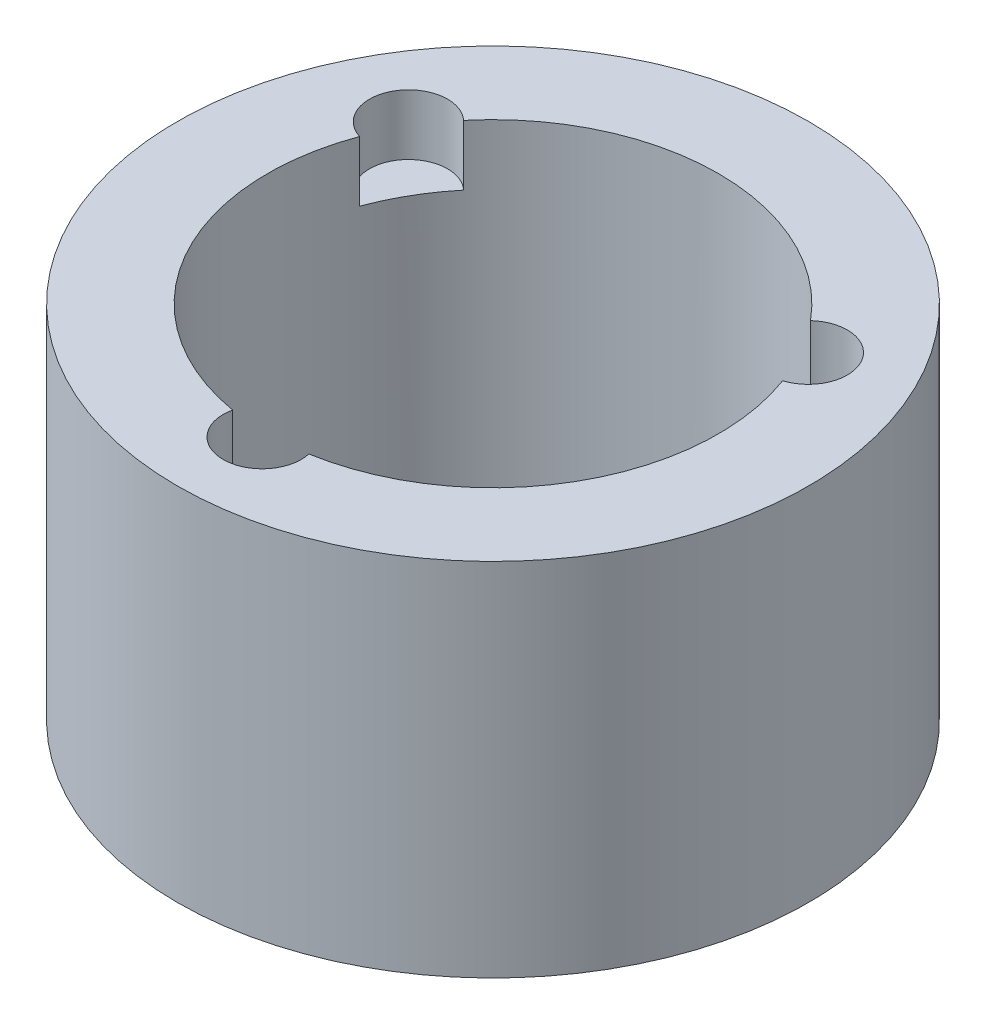
ISO-10303-21;
HEADER;
FILE_DESCRIPTION(('STEP AP214'),'2;1');
FILE_NAME('part.step','',(''),(''),'','','');
FILE_SCHEMA(('AUTOMOTIVE_DESIGN { 1 0 10303 214 1 1 1 1 }'));
ENDSEC;
DATA;
#1=APPLICATION_CONTEXT('core data for automotive mechanical design processes');
#2=APPLICATION_PROTOCOL_DEFINITION('international standard','automotive_design',2000,#1);
#3=PRODUCT_CONTEXT('',#1,'mechanical');
#4=PRODUCT('Part','Part','',(#3));
#5=PRODUCT_RELATED_PRODUCT_CATEGORY('part','',(#4));
#6=PRODUCT_DEFINITION_FORMATION('','',#4);
#7=PRODUCT_DEFINITION_CONTEXT('part definition',#1,'design');
#8=PRODUCT_DEFINITION('design','',#6,#7);
#9=PRODUCT_DEFINITION_SHAPE('','',#8);
#10=(LENGTH_UNIT() NAMED_UNIT(*) SI_UNIT(.MILLI.,.METRE.));
#11=(NAMED_UNIT(*) PLANE_ANGLE_UNIT() SI_UNIT($,.RADIAN.));
#12=(NAMED_UNIT(*) SI_UNIT($,.STERADIAN.) SOLID_ANGLE_UNIT());
#13=UNCERTAINTY_MEASURE_WITH_UNIT(LENGTH_MEASURE(1.E-05),#10,'distance_accuracy_value','');
#14=(GEOMETRIC_REPRESENTATION_CONTEXT(3) GLOBAL_UNCERTAINTY_ASSIGNED_CONTEXT((#13)) GLOBAL_UNIT_ASSIGNED_CONTEXT((#10,
#11,#12)) REPRESENTATION_CONTEXT('',''));
#15=CARTESIAN_POINT('',(0.,0.,0.));
#16=DIRECTION('',(0.,0.,1.));
#17=DIRECTION('',(1.,0.,0.));
#18=AXIS2_PLACEMENT_3D('',#15,#16,#17);
#19=CARTESIAN_POINT('',(0.,50.8,0.));
#20=DIRECTION('',(0.,1.,0.));
#21=DIRECTION('',(0.,0.,1.));
#22=AXIS2_PLACEMENT_3D('',#19,#20,#21);
#23=PLANE('',#22);
#24=CARTESIAN_POINT('',(28.1458256229943,50.8,-16.2499999999999));
#25=DIRECTION('',(0.,1.,0.));
#26=DIRECTION('',(0.,0.,1.));
#27=AXIS2_PLACEMENT_3D('',#24,#25,#26);
#28=CIRCLE('',#27,5.5);
#29=CARTESIAN_POINT('',(29.7837588929475,50.8,-10.999554818572));
#30=VERTEX_POINT('',#29);
#31=CARTESIAN_POINT('',(24.4177733496767,50.8,-20.2937144121972));
#32=VERTEX_POINT('',#31);
#33=EDGE_CURVE('E86',#30,#32,#28,.T.);
#34=ORIENTED_EDGE('',*,*,#33,.F.);
#35=CARTESIAN_POINT('',(0.,50.8,0.));
#36=DIRECTION('',(0.,1.,0.));
#37=DIRECTION('',(0.,0.,1.));
#38=AXIS2_PLACEMENT_3D('',#35,#36,#37);
#39=CIRCLE('',#38,31.75);
#40=CARTESIAN_POINT('',(5.36598554327085,50.8,31.2932692307692));
#41=VERTEX_POINT('',#40);
#42=EDGE_CURVE('E96',#41,#30,#39,.T.);
#43=ORIENTED_EDGE('',*,*,#42,.F.);
#44=CARTESIAN_POINT('',(0.,50.8,32.5));
#45=DIRECTION('',(0.,1.,0.));
#46=DIRECTION('',(0.,0.,1.));
#47=AXIS2_PLACEMENT_3D('',#44,#45,#46);
#48=CIRCLE('',#47,5.5);
#49=CARTESIAN_POINT('',(-5.36598554327084,50.8,31.2932692307692));
#50=VERTEX_POINT('',#49);
#51=EDGE_CURVE('E232',#50,#41,#48,.T.);
#52=ORIENTED_EDGE('',*,*,#51,.F.);
#53=CARTESIAN_POINT('',(-29.7837588929474,50.8,-10.9995548185722));
#54=VERTEX_POINT('',#53);
#55=EDGE_CURVE('E105',#54,#50,#39,.T.);
#56=ORIENTED_EDGE('',*,*,#55,.F.);
#57=CARTESIAN_POINT('',(-28.1458256229942,50.8,-16.2500000000001));
#58=DIRECTION('',(0.,1.,0.));
#59=DIRECTION('',(0.,0.,1.));
#60=AXIS2_PLACEMENT_3D('',#57,#58,#59);
#61=CIRCLE('',#60,5.5);
#62=CARTESIAN_POINT('',(-24.4177733496766,50.8,-20.2937144121973));
#63=VERTEX_POINT('',#62);
#64=EDGE_CURVE('E112',#63,#54,#61,.T.);
#65=ORIENTED_EDGE('',*,*,#64,.F.);
#66=EDGE_CURVE('E98',#32,#63,#39,.T.);
#67=ORIENTED_EDGE('',*,*,#66,.F.);
#68=EDGE_LOOP('',(#34,#43,#52,#56,#65,#67));
#69=FACE_BOUND('',#68,.T.);
#70=CARTESIAN_POINT('',(0.,50.8,0.));
#71=DIRECTION('',(0.,1.,0.));
#72=DIRECTION('',(0.,0.,1.));
#73=AXIS2_PLACEMENT_3D('',#70,#71,#72);
#74=CIRCLE('',#73,44.45);
#75=CARTESIAN_POINT('',(0.,50.8,44.45));
#76=VERTEX_POINT('',#75);
#77=EDGE_CURVE('E117',#76,#76,#74,.T.);
#78=ORIENTED_EDGE('',*,*,#77,.T.);
#79=EDGE_LOOP('',(#78));
#80=FACE_BOUND('',#79,.T.);
#81=ADVANCED_FACE('F33',(#69,#80),#23,.T.);
#82=CARTESIAN_POINT('',(0.,0.,0.));
#83=DIRECTION('',(0.,1.,0.));
#84=DIRECTION('',(0.,0.,1.));
#85=AXIS2_PLACEMENT_3D('',#82,#83,#84);
#86=PLANE('',#85);
#87=CARTESIAN_POINT('',(0.,0.,0.));
#88=DIRECTION('',(0.,1.,0.));
#89=DIRECTION('',(0.,0.,1.));
#90=AXIS2_PLACEMENT_3D('',#87,#88,#89);
#91=CIRCLE('',#90,44.45);
#92=CARTESIAN_POINT('',(0.,0.,44.45));
#93=VERTEX_POINT('',#92);
#94=EDGE_CURVE('E108',#93,#93,#91,.T.);
#95=ORIENTED_EDGE('',*,*,#94,.F.);
#96=EDGE_LOOP('',(#95));
#97=FACE_BOUND('',#96,.T.);
#98=CARTESIAN_POINT('',(0.,0.,0.));
#99=DIRECTION('',(0.,1.,0.));
#100=DIRECTION('',(0.,0.,1.));
#101=AXIS2_PLACEMENT_3D('',#98,#99,#100);
#102=CIRCLE('',#101,31.75);
#103=CARTESIAN_POINT('',(0.,0.,31.75));
#104=VERTEX_POINT('',#103);
#105=EDGE_CURVE('E109',#104,#104,#102,.T.);
#106=ORIENTED_EDGE('',*,*,#105,.T.);
#107=EDGE_LOOP('',(#106));
#108=FACE_BOUND('',#107,.T.);
#109=ADVANCED_FACE('F146',(#97,#108),#86,.F.);
#110=CARTESIAN_POINT('',(0.,50.8,0.));
#111=DIRECTION('',(0.,-1.,0.));
#112=DIRECTION('',(0.,0.,-1.));
#113=AXIS2_PLACEMENT_3D('',#110,#111,#112);
#114=CYLINDRICAL_SURFACE('',#113,44.45);
#115=ORIENTED_EDGE('',*,*,#77,.F.);
#116=EDGE_LOOP('',(#115));
#117=FACE_BOUND('',#116,.T.);
#118=ORIENTED_EDGE('',*,*,#94,.T.);
#119=EDGE_LOOP('',(#118));
#120=FACE_BOUND('',#119,.T.);
#121=ADVANCED_FACE('F35',(#117,#120),#114,.T.);
#122=CARTESIAN_POINT('',(0.,50.8,0.));
#123=DIRECTION('',(0.,-1.,0.));
#124=DIRECTION('',(0.,0.,-1.));
#125=AXIS2_PLACEMENT_3D('',#122,#123,#124);
#126=CYLINDRICAL_SURFACE('',#125,31.75);
#127=DIRECTION('',(0.,1.,0.));
#128=VECTOR('',#127,1.);
#129=CARTESIAN_POINT('',(29.7837588929475,46.55,-10.999554818572));
#130=LINE('',#129,#128);
#131=CARTESIAN_POINT('',(29.7837588929475,42.3,-10.999554818572));
#132=VERTEX_POINT('',#131);
#133=EDGE_CURVE('E11',#132,#30,#130,.T.);
#134=ORIENTED_EDGE('',*,*,#133,.F.);
#135=CARTESIAN_POINT('',(0.,42.3,0.));
#136=DIRECTION('',(0.,1.,0.));
#137=DIRECTION('',(0.,0.,1.));
#138=AXIS2_PLACEMENT_3D('',#135,#136,#137);
#139=CIRCLE('',#138,31.75);
#140=CARTESIAN_POINT('',(24.4177733496767,42.3,-20.2937144121972));
#141=VERTEX_POINT('',#140);
#142=EDGE_CURVE('E136',#132,#141,#139,.T.);
#143=ORIENTED_EDGE('',*,*,#142,.T.);
#144=DIRECTION('',(0.,1.,0.));
#145=VECTOR('',#144,1.);
#146=CARTESIAN_POINT('',(24.4177733496767,46.55,-20.2937144121972));
#147=LINE('',#146,#145);
#148=EDGE_CURVE('E41',#32,#141,#147,.F.);
#149=ORIENTED_EDGE('',*,*,#148,.F.);
#150=ORIENTED_EDGE('',*,*,#66,.T.);
#151=DIRECTION('',(0.,1.,0.));
#152=VECTOR('',#151,1.);
#153=CARTESIAN_POINT('',(-24.4177733496766,46.55,-20.2937144121973));
#154=LINE('',#153,#152);
#155=CARTESIAN_POINT('',(-24.4177733496766,42.3,-20.2937144121973));
#156=VERTEX_POINT('',#155);
#157=EDGE_CURVE('E128',#156,#63,#154,.T.);
#158=ORIENTED_EDGE('',*,*,#157,.F.);
#159=CARTESIAN_POINT('',(0.,42.3,0.));
#160=DIRECTION('',(0.,1.,0.));
#161=DIRECTION('',(0.,0.,1.));
#162=AXIS2_PLACEMENT_3D('',#159,#160,#161);
#163=CIRCLE('',#162,31.75);
#164=CARTESIAN_POINT('',(-29.7837588929474,42.3,-10.9995548185722));
#165=VERTEX_POINT('',#164);
#166=EDGE_CURVE('E120',#156,#165,#163,.T.);
#167=ORIENTED_EDGE('',*,*,#166,.T.);
#168=DIRECTION('',(0.,1.,0.));
#169=VECTOR('',#168,1.);
#170=CARTESIAN_POINT('',(-29.7837588929474,46.55,-10.9995548185722));
#171=LINE('',#170,#169);
#172=EDGE_CURVE('E125',#54,#165,#171,.F.);
#173=ORIENTED_EDGE('',*,*,#172,.F.);
#174=ORIENTED_EDGE('',*,*,#55,.T.);
#175=DIRECTION('',(0.,1.,0.));
#176=VECTOR('',#175,1.);
#177=CARTESIAN_POINT('',(-5.36598554327084,46.55,31.2932692307692));
#178=LINE('',#177,#176);
#179=CARTESIAN_POINT('',(-5.36598554327084,42.3,31.2932692307692));
#180=VERTEX_POINT('',#179);
#181=EDGE_CURVE('E134',#180,#50,#178,.T.);
#182=ORIENTED_EDGE('',*,*,#181,.F.);
#183=CARTESIAN_POINT('',(0.,42.3,0.));
#184=DIRECTION('',(0.,1.,0.));
#185=DIRECTION('',(0.,0.,1.));
#186=AXIS2_PLACEMENT_3D('',#183,#184,#185);
#187=CIRCLE('',#186,31.75);
#188=CARTESIAN_POINT('',(5.36598554327085,42.3,31.2932692307692));
#189=VERTEX_POINT('',#188);
#190=EDGE_CURVE('E131',#180,#189,#187,.T.);
#191=ORIENTED_EDGE('',*,*,#190,.T.);
#192=DIRECTION('',(0.,1.,0.));
#193=VECTOR('',#192,1.);
#194=CARTESIAN_POINT('',(5.36598554327085,46.55,31.2932692307692));
#195=LINE('',#194,#193);
#196=EDGE_CURVE('E104',#41,#189,#195,.F.);
#197=ORIENTED_EDGE('',*,*,#196,.F.);
#198=ORIENTED_EDGE('',*,*,#42,.T.);
#199=EDGE_LOOP('',(#134,#143,#149,#150,#158,#167,#173,#174,#182,#191,#197,#198));
#200=FACE_BOUND('',#199,.T.);
#201=ORIENTED_EDGE('',*,*,#105,.F.);
#202=EDGE_LOOP('',(#201));
#203=FACE_BOUND('',#202,.T.);
#204=ADVANCED_FACE('F101',(#200,#203),#126,.F.);
#205=CARTESIAN_POINT('',(-28.1458256229942,42.3,-16.2500000000001));
#206=DIRECTION('',(0.,1.,0.));
#207=DIRECTION('',(0.,0.,1.));
#208=AXIS2_PLACEMENT_3D('',#205,#206,#207);
#209=CYLINDRICAL_SURFACE('',#208,5.5);
#210=ORIENTED_EDGE('',*,*,#157,.T.);
#211=ORIENTED_EDGE('',*,*,#64,.T.);
#212=ORIENTED_EDGE('',*,*,#172,.T.);
#213=CARTESIAN_POINT('',(-28.1458256229942,42.3,-16.2500000000001));
#214=DIRECTION('',(0.,1.,0.));
#215=DIRECTION('',(0.,0.,1.));
#216=AXIS2_PLACEMENT_3D('',#213,#214,#215);
#217=CIRCLE('',#216,5.5);
#218=EDGE_CURVE('E116',#156,#165,#217,.T.);
#219=ORIENTED_EDGE('',*,*,#218,.F.);
#220=EDGE_LOOP('',(#210,#211,#212,#219));
#221=FACE_BOUND('',#220,.T.);
#222=ADVANCED_FACE('F155',(#221),#209,.F.);
#223=CARTESIAN_POINT('',(-28.1458256229942,42.3,-16.2500000000001));
#224=DIRECTION('',(0.,1.,0.));
#225=DIRECTION('',(0.,0.,1.));
#226=AXIS2_PLACEMENT_3D('',#223,#224,#225);
#227=PLANE('',#226);
#228=ORIENTED_EDGE('',*,*,#218,.T.);
#229=ORIENTED_EDGE('',*,*,#166,.F.);
#230=EDGE_LOOP('',(#228,#229));
#231=FACE_BOUND('',#230,.T.);
#232=ADVANCED_FACE('F158',(#231),#227,.T.);
#233=CARTESIAN_POINT('',(0.,42.3,32.5));
#234=DIRECTION('',(0.,1.,0.));
#235=DIRECTION('',(0.,0.,1.));
#236=AXIS2_PLACEMENT_3D('',#233,#234,#235);
#237=CYLINDRICAL_SURFACE('',#236,5.5);
#238=ORIENTED_EDGE('',*,*,#181,.T.);
#239=ORIENTED_EDGE('',*,*,#51,.T.);
#240=ORIENTED_EDGE('',*,*,#196,.T.);
#241=CARTESIAN_POINT('',(0.,42.3,32.5));
#242=DIRECTION('',(0.,1.,0.));
#243=DIRECTION('',(0.,0.,1.));
#244=AXIS2_PLACEMENT_3D('',#241,#242,#243);
#245=CIRCLE('',#244,5.5);
#246=EDGE_CURVE('E54',#180,#189,#245,.T.);
#247=ORIENTED_EDGE('',*,*,#246,.F.);
#248=EDGE_LOOP('',(#238,#239,#240,#247));
#249=FACE_BOUND('',#248,.T.);
#250=ADVANCED_FACE('F162',(#249),#237,.F.);
#251=CARTESIAN_POINT('',(0.,42.3,32.5));
#252=DIRECTION('',(0.,1.,0.));
#253=DIRECTION('',(0.,0.,1.));
#254=AXIS2_PLACEMENT_3D('',#251,#252,#253);
#255=PLANE('',#254);
#256=ORIENTED_EDGE('',*,*,#246,.T.);
#257=ORIENTED_EDGE('',*,*,#190,.F.);
#258=EDGE_LOOP('',(#256,#257));
#259=FACE_BOUND('',#258,.T.);
#260=ADVANCED_FACE('F143',(#259),#255,.T.);
#261=CARTESIAN_POINT('',(28.1458256229943,42.3,-16.2499999999999));
#262=DIRECTION('',(0.,1.,0.));
#263=DIRECTION('',(0.,0.,1.));
#264=AXIS2_PLACEMENT_3D('',#261,#262,#263);
#265=CYLINDRICAL_SURFACE('',#264,5.5);
#266=ORIENTED_EDGE('',*,*,#133,.T.);
#267=ORIENTED_EDGE('',*,*,#33,.T.);
#268=ORIENTED_EDGE('',*,*,#148,.T.);
#269=CARTESIAN_POINT('',(28.1458256229943,42.3,-16.2499999999999));
#270=DIRECTION('',(0.,1.,0.));
#271=DIRECTION('',(0.,0.,1.));
#272=AXIS2_PLACEMENT_3D('',#269,#270,#271);
#273=CIRCLE('',#272,5.5);
#274=EDGE_CURVE('E47',#132,#141,#273,.T.);
#275=ORIENTED_EDGE('',*,*,#274,.F.);
#276=EDGE_LOOP('',(#266,#267,#268,#275));
#277=FACE_BOUND('',#276,.T.);
#278=ADVANCED_FACE('F85',(#277),#265,.F.);
#279=CARTESIAN_POINT('',(28.1458256229943,42.3,-16.2499999999999));
#280=DIRECTION('',(0.,1.,0.));
#281=DIRECTION('',(0.,0.,1.));
#282=AXIS2_PLACEMENT_3D('',#279,#280,#281);
#283=PLANE('',#282);
#284=ORIENTED_EDGE('',*,*,#274,.T.);
#285=ORIENTED_EDGE('',*,*,#142,.F.);
#286=EDGE_LOOP('',(#284,#285));
#287=FACE_BOUND('',#286,.T.);
#288=ADVANCED_FACE('F137',(#287),#283,.T.);
#289=CLOSED_SHELL('',(#81,#109,#121,#204,#222,#232,#250,#260,#278,#288));
#290=MANIFOLD_SOLID_BREP('B2',#289);
#291=ADVANCED_BREP_SHAPE_REPRESENTATION('',(#18,#290),#14);
#292=SHAPE_DEFINITION_REPRESENTATION(#9,#291);
ENDSEC;
END-ISO-10303-21;
